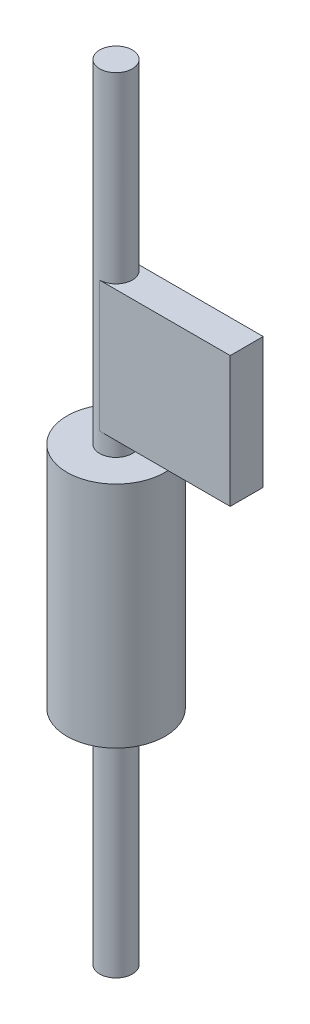
ISO-10303-21;
HEADER;
FILE_DESCRIPTION(('STEP AP214'),'2;1');
FILE_NAME('part.step','',(''),(''),'','','');
FILE_SCHEMA(('AUTOMOTIVE_DESIGN { 1 0 10303 214 1 1 1 1 }'));
ENDSEC;
DATA;
#1=APPLICATION_CONTEXT('core data for automotive mechanical design processes');
#2=APPLICATION_PROTOCOL_DEFINITION('international standard','automotive_design',2000,#1);
#3=PRODUCT_CONTEXT('',#1,'mechanical');
#4=PRODUCT('Part','Part','',(#3));
#5=PRODUCT_RELATED_PRODUCT_CATEGORY('part','',(#4));
#6=PRODUCT_DEFINITION_FORMATION('','',#4);
#7=PRODUCT_DEFINITION_CONTEXT('part definition',#1,'design');
#8=PRODUCT_DEFINITION('design','',#6,#7);
#9=PRODUCT_DEFINITION_SHAPE('','',#8);
#10=(LENGTH_UNIT() NAMED_UNIT(*) SI_UNIT(.MILLI.,.METRE.));
#11=(NAMED_UNIT(*) PLANE_ANGLE_UNIT() SI_UNIT($,.RADIAN.));
#12=(NAMED_UNIT(*) SI_UNIT($,.STERADIAN.) SOLID_ANGLE_UNIT());
#13=UNCERTAINTY_MEASURE_WITH_UNIT(LENGTH_MEASURE(1.E-05),#10,'distance_accuracy_value','');
#14=(GEOMETRIC_REPRESENTATION_CONTEXT(3) GLOBAL_UNCERTAINTY_ASSIGNED_CONTEXT((#13)) GLOBAL_UNIT_ASSIGNED_CONTEXT((#10,
#11,#12)) REPRESENTATION_CONTEXT('',''));
#15=CARTESIAN_POINT('',(0.,0.,0.));
#16=DIRECTION('',(0.,0.,1.));
#17=DIRECTION('',(1.,0.,0.));
#18=AXIS2_PLACEMENT_3D('',#15,#16,#17);
#19=CARTESIAN_POINT('',(0.,152.4,0.));
#20=DIRECTION('',(0.,-1.,0.));
#21=DIRECTION('',(0.,0.,-1.));
#22=AXIS2_PLACEMENT_3D('',#19,#20,#21);
#23=CYLINDRICAL_SURFACE('',#22,3.175);
#24=CARTESIAN_POINT('',(0.,87.63,0.));
#25=DIRECTION('',(0.,1.,0.));
#26=DIRECTION('',(0.,0.,1.));
#27=AXIS2_PLACEMENT_3D('',#24,#25,#26);
#28=CIRCLE('',#27,3.175);
#29=CARTESIAN_POINT('',(0.,87.63,3.175));
#30=VERTEX_POINT('',#29);
#31=EDGE_CURVE('E39',#30,#30,#28,.T.);
#32=ORIENTED_EDGE('',*,*,#31,.T.);
#33=EDGE_LOOP('',(#32));
#34=FACE_BOUND('',#33,.T.);
#35=CARTESIAN_POINT('',(0.,152.4,0.));
#36=DIRECTION('',(0.,1.,0.));
#37=DIRECTION('',(0.,0.,1.));
#38=AXIS2_PLACEMENT_3D('',#35,#36,#37);
#39=CIRCLE('',#38,3.175);
#40=CARTESIAN_POINT('',(0.,152.4,3.175));
#41=VERTEX_POINT('',#40);
#42=EDGE_CURVE('E115',#41,#41,#39,.T.);
#43=ORIENTED_EDGE('',*,*,#42,.F.);
#44=EDGE_LOOP('',(#43));
#45=FACE_BOUND('',#44,.T.);
#46=DIRECTION('',(0.,-1.,0.));
#47=VECTOR('',#46,1.);
#48=CARTESIAN_POINT('',(0.,152.4,3.175));
#49=LINE('',#48,#47);
#50=CARTESIAN_POINT('',(0.,116.84,3.175));
#51=VERTEX_POINT('',#50);
#52=CARTESIAN_POINT('',(0.,91.44,3.175));
#53=VERTEX_POINT('',#52);
#54=EDGE_CURVE('E44',#51,#53,#49,.T.);
#55=ORIENTED_EDGE('',*,*,#54,.F.);
#56=CARTESIAN_POINT('',(0.,116.84,0.));
#57=DIRECTION('',(0.,-1.,0.));
#58=DIRECTION('',(0.,0.,-1.));
#59=AXIS2_PLACEMENT_3D('',#56,#57,#58);
#60=CIRCLE('',#59,3.175);
#61=CARTESIAN_POINT('',(0.,116.84,-3.175));
#62=VERTEX_POINT('',#61);
#63=EDGE_CURVE('E126',#62,#51,#60,.T.);
#64=ORIENTED_EDGE('',*,*,#63,.F.);
#65=DIRECTION('',(0.,-1.,0.));
#66=VECTOR('',#65,1.);
#67=CARTESIAN_POINT('',(0.,152.4,-3.175));
#68=LINE('',#67,#66);
#69=CARTESIAN_POINT('',(0.,91.44,-3.175));
#70=VERTEX_POINT('',#69);
#71=EDGE_CURVE('E122',#70,#62,#68,.F.);
#72=ORIENTED_EDGE('',*,*,#71,.F.);
#73=CARTESIAN_POINT('',(0.,91.44,0.));
#74=DIRECTION('',(0.,1.,0.));
#75=DIRECTION('',(0.,0.,1.));
#76=AXIS2_PLACEMENT_3D('',#73,#74,#75);
#77=CIRCLE('',#76,3.175);
#78=EDGE_CURVE('E51',#53,#70,#77,.T.);
#79=ORIENTED_EDGE('',*,*,#78,.F.);
#80=EDGE_LOOP('',(#55,#64,#72,#79));
#81=FACE_BOUND('',#80,.T.);
#82=ADVANCED_FACE('F36',(#34,#45,#81),#23,.T.);
#83=CARTESIAN_POINT('',(0.,152.4,0.));
#84=DIRECTION('',(0.,1.,0.));
#85=DIRECTION('',(0.,0.,1.));
#86=AXIS2_PLACEMENT_3D('',#83,#84,#85);
#87=PLANE('',#86);
#88=ORIENTED_EDGE('',*,*,#42,.T.);
#89=EDGE_LOOP('',(#88));
#90=FACE_BOUND('',#89,.T.);
#91=ADVANCED_FACE('F179',(#90),#87,.T.);
#92=CARTESIAN_POINT('',(25.4,91.44,3.20675));
#93=DIRECTION('',(0.,1.,0.));
#94=DIRECTION('',(0.,0.,1.));
#95=AXIS2_PLACEMENT_3D('',#92,#93,#94);
#96=PLANE('',#95);
#97=DIRECTION('',(0.,0.,-1.));
#98=VECTOR('',#97,1.);
#99=CARTESIAN_POINT('',(0.,91.44,3.20675));
#100=LINE('',#99,#98);
#101=CARTESIAN_POINT('',(0.,91.44,3.20675));
#102=VERTEX_POINT('',#101);
#103=EDGE_CURVE('E132',#102,#53,#100,.T.);
#104=ORIENTED_EDGE('',*,*,#103,.T.);
#105=ORIENTED_EDGE('',*,*,#78,.T.);
#106=CARTESIAN_POINT('',(0.,91.44,-3.20675));
#107=VERTEX_POINT('',#106);
#108=EDGE_CURVE('E136',#70,#107,#100,.T.);
#109=ORIENTED_EDGE('',*,*,#108,.T.);
#110=DIRECTION('',(-1.,0.,0.));
#111=VECTOR('',#110,1.);
#112=CARTESIAN_POINT('',(25.4,91.44,-3.20675));
#113=LINE('',#112,#111);
#114=CARTESIAN_POINT('',(25.4,91.44,-3.20675));
#115=VERTEX_POINT('',#114);
#116=EDGE_CURVE('E94',#115,#107,#113,.T.);
#117=ORIENTED_EDGE('',*,*,#116,.F.);
#118=DIRECTION('',(0.,0.,-1.));
#119=VECTOR('',#118,1.);
#120=CARTESIAN_POINT('',(25.4,91.44,3.20675));
#121=LINE('',#120,#119);
#122=CARTESIAN_POINT('',(25.4,91.44,3.20675));
#123=VERTEX_POINT('',#122);
#124=EDGE_CURVE('E86',#123,#115,#121,.T.);
#125=ORIENTED_EDGE('',*,*,#124,.F.);
#126=DIRECTION('',(-1.,0.,0.));
#127=VECTOR('',#126,1.);
#128=CARTESIAN_POINT('',(25.4,91.44,3.20675));
#129=LINE('',#128,#127);
#130=EDGE_CURVE('E91',#123,#102,#129,.T.);
#131=ORIENTED_EDGE('',*,*,#130,.T.);
#132=EDGE_LOOP('',(#104,#105,#109,#117,#125,#131));
#133=FACE_BOUND('',#132,.T.);
#134=ADVANCED_FACE('F89',(#133),#96,.F.);
#135=CARTESIAN_POINT('',(25.4,116.84,3.20675));
#136=DIRECTION('',(0.,-1.,0.));
#137=DIRECTION('',(0.,0.,-1.));
#138=AXIS2_PLACEMENT_3D('',#135,#136,#137);
#139=PLANE('',#138);
#140=DIRECTION('',(0.,0.,1.));
#141=VECTOR('',#140,1.);
#142=CARTESIAN_POINT('',(0.,116.84,3.20675));
#143=LINE('',#142,#141);
#144=CARTESIAN_POINT('',(0.,116.84,-3.20675));
#145=VERTEX_POINT('',#144);
#146=EDGE_CURVE('E107',#145,#62,#143,.T.);
#147=ORIENTED_EDGE('',*,*,#146,.T.);
#148=ORIENTED_EDGE('',*,*,#63,.T.);
#149=CARTESIAN_POINT('',(0.,116.84,3.20675));
#150=VERTEX_POINT('',#149);
#151=EDGE_CURVE('E133',#51,#150,#143,.T.);
#152=ORIENTED_EDGE('',*,*,#151,.T.);
#153=DIRECTION('',(-1.,0.,0.));
#154=VECTOR('',#153,1.);
#155=CARTESIAN_POINT('',(25.4,116.84,3.20675));
#156=LINE('',#155,#154);
#157=CARTESIAN_POINT('',(25.4,116.84,3.20675));
#158=VERTEX_POINT('',#157);
#159=EDGE_CURVE('E144',#158,#150,#156,.T.);
#160=ORIENTED_EDGE('',*,*,#159,.F.);
#161=DIRECTION('',(0.,0.,1.));
#162=VECTOR('',#161,1.);
#163=CARTESIAN_POINT('',(25.4,116.84,3.20675));
#164=LINE('',#163,#162);
#165=CARTESIAN_POINT('',(25.4,116.84,-3.20675));
#166=VERTEX_POINT('',#165);
#167=EDGE_CURVE('E103',#166,#158,#164,.T.);
#168=ORIENTED_EDGE('',*,*,#167,.F.);
#169=DIRECTION('',(-1.,0.,0.));
#170=VECTOR('',#169,1.);
#171=CARTESIAN_POINT('',(25.4,116.84,-3.20675));
#172=LINE('',#171,#170);
#173=EDGE_CURVE('E117',#166,#145,#172,.T.);
#174=ORIENTED_EDGE('',*,*,#173,.T.);
#175=EDGE_LOOP('',(#147,#148,#152,#160,#168,#174));
#176=FACE_BOUND('',#175,.T.);
#177=ADVANCED_FACE('F149',(#176),#139,.F.);
#178=CARTESIAN_POINT('',(0.,0.,0.));
#179=DIRECTION('',(1.,0.,0.));
#180=DIRECTION('',(0.,0.,-1.));
#181=AXIS2_PLACEMENT_3D('',#178,#179,#180);
#182=PLANE('',#181);
#183=ORIENTED_EDGE('',*,*,#151,.F.);
#184=ORIENTED_EDGE('',*,*,#54,.T.);
#185=ORIENTED_EDGE('',*,*,#103,.F.);
#186=DIRECTION('',(0.,-1.,0.));
#187=VECTOR('',#186,1.);
#188=CARTESIAN_POINT('',(0.,116.84,3.20675));
#189=LINE('',#188,#187);
#190=EDGE_CURVE('E111',#150,#102,#189,.T.);
#191=ORIENTED_EDGE('',*,*,#190,.F.);
#192=EDGE_LOOP('',(#183,#184,#185,#191));
#193=FACE_BOUND('',#192,.T.);
#194=ADVANCED_FACE('F131',(#193),#182,.F.);
#195=ORIENTED_EDGE('',*,*,#108,.F.);
#196=ORIENTED_EDGE('',*,*,#71,.T.);
#197=ORIENTED_EDGE('',*,*,#146,.F.);
#198=DIRECTION('',(0.,1.,0.));
#199=VECTOR('',#198,1.);
#200=CARTESIAN_POINT('',(0.,116.84,-3.20675));
#201=LINE('',#200,#199);
#202=EDGE_CURVE('E135',#107,#145,#201,.T.);
#203=ORIENTED_EDGE('',*,*,#202,.F.);
#204=EDGE_LOOP('',(#195,#196,#197,#203));
#205=FACE_BOUND('',#204,.T.);
#206=ADVANCED_FACE('F153',(#205),#182,.F.);
#207=CARTESIAN_POINT('',(25.4,116.84,3.20675));
#208=DIRECTION('',(0.,0.,-1.));
#209=DIRECTION('',(0.,1.,0.));
#210=AXIS2_PLACEMENT_3D('',#207,#208,#209);
#211=PLANE('',#210);
#212=ORIENTED_EDGE('',*,*,#190,.T.);
#213=ORIENTED_EDGE('',*,*,#130,.F.);
#214=DIRECTION('',(0.,-1.,0.));
#215=VECTOR('',#214,1.);
#216=CARTESIAN_POINT('',(25.4,116.84,3.20675));
#217=LINE('',#216,#215);
#218=EDGE_CURVE('E98',#158,#123,#217,.T.);
#219=ORIENTED_EDGE('',*,*,#218,.F.);
#220=ORIENTED_EDGE('',*,*,#159,.T.);
#221=EDGE_LOOP('',(#212,#213,#219,#220));
#222=FACE_BOUND('',#221,.T.);
#223=ADVANCED_FACE('F109',(#222),#211,.F.);
#224=CARTESIAN_POINT('',(25.4,116.84,-3.20675));
#225=DIRECTION('',(0.,0.,1.));
#226=DIRECTION('',(0.,-1.,0.));
#227=AXIS2_PLACEMENT_3D('',#224,#225,#226);
#228=PLANE('',#227);
#229=ORIENTED_EDGE('',*,*,#202,.T.);
#230=ORIENTED_EDGE('',*,*,#173,.F.);
#231=DIRECTION('',(0.,1.,0.));
#232=VECTOR('',#231,1.);
#233=CARTESIAN_POINT('',(25.4,116.84,-3.20675));
#234=LINE('',#233,#232);
#235=EDGE_CURVE('E97',#115,#166,#234,.T.);
#236=ORIENTED_EDGE('',*,*,#235,.F.);
#237=ORIENTED_EDGE('',*,*,#116,.T.);
#238=EDGE_LOOP('',(#229,#230,#236,#237));
#239=FACE_BOUND('',#238,.T.);
#240=ADVANCED_FACE('F166',(#239),#228,.F.);
#241=CARTESIAN_POINT('',(25.4,0.,0.));
#242=DIRECTION('',(1.,0.,0.));
#243=DIRECTION('',(0.,0.,-1.));
#244=AXIS2_PLACEMENT_3D('',#241,#242,#243);
#245=PLANE('',#244);
#246=ORIENTED_EDGE('',*,*,#218,.T.);
#247=ORIENTED_EDGE('',*,*,#124,.T.);
#248=ORIENTED_EDGE('',*,*,#235,.T.);
#249=ORIENTED_EDGE('',*,*,#167,.T.);
#250=EDGE_LOOP('',(#246,#247,#248,#249));
#251=FACE_BOUND('',#250,.T.);
#252=ADVANCED_FACE('F101',(#251),#245,.T.);
#253=CARTESIAN_POINT('',(0.,87.63,0.));
#254=DIRECTION('',(0.,1.,0.));
#255=DIRECTION('',(0.,0.,1.));
#256=AXIS2_PLACEMENT_3D('',#253,#254,#255);
#257=PLANE('',#256);
#258=CARTESIAN_POINT('',(0.,87.63,0.));
#259=DIRECTION('',(0.,1.,0.));
#260=DIRECTION('',(0.,0.,1.));
#261=AXIS2_PLACEMENT_3D('',#258,#259,#260);
#262=CIRCLE('',#261,9.525);
#263=CARTESIAN_POINT('',(0.,87.63,9.525));
#264=VERTEX_POINT('',#263);
#265=EDGE_CURVE('E155',#264,#264,#262,.T.);
#266=ORIENTED_EDGE('',*,*,#265,.T.);
#267=EDGE_LOOP('',(#266));
#268=FACE_BOUND('',#267,.T.);
#269=ORIENTED_EDGE('',*,*,#31,.F.);
#270=EDGE_LOOP('',(#269));
#271=FACE_BOUND('',#270,.T.);
#272=ADVANCED_FACE('F173',(#268,#271),#257,.T.);
#273=CARTESIAN_POINT('',(0.,43.18,0.));
#274=DIRECTION('',(0.,1.,0.));
#275=DIRECTION('',(0.,0.,1.));
#276=AXIS2_PLACEMENT_3D('',#273,#274,#275);
#277=PLANE('',#276);
#278=CARTESIAN_POINT('',(0.,43.18,0.));
#279=DIRECTION('',(0.,1.,0.));
#280=DIRECTION('',(0.,0.,1.));
#281=AXIS2_PLACEMENT_3D('',#278,#279,#280);
#282=CIRCLE('',#281,9.525);
#283=CARTESIAN_POINT('',(0.,43.18,9.525));
#284=VERTEX_POINT('',#283);
#285=EDGE_CURVE('E159',#284,#284,#282,.T.);
#286=ORIENTED_EDGE('',*,*,#285,.F.);
#287=EDGE_LOOP('',(#286));
#288=FACE_BOUND('',#287,.T.);
#289=CARTESIAN_POINT('',(0.,43.18,0.));
#290=DIRECTION('',(0.,1.,0.));
#291=DIRECTION('',(0.,0.,1.));
#292=AXIS2_PLACEMENT_3D('',#289,#290,#291);
#293=CIRCLE('',#292,3.175);
#294=CARTESIAN_POINT('',(0.,43.18,3.175));
#295=VERTEX_POINT('',#294);
#296=EDGE_CURVE('E11',#295,#295,#293,.T.);
#297=ORIENTED_EDGE('',*,*,#296,.T.);
#298=EDGE_LOOP('',(#297));
#299=FACE_BOUND('',#298,.T.);
#300=ADVANCED_FACE('F199',(#288,#299),#277,.F.);
#301=CARTESIAN_POINT('',(0.,87.63,0.));
#302=DIRECTION('',(0.,-1.,0.));
#303=DIRECTION('',(0.,0.,-1.));
#304=AXIS2_PLACEMENT_3D('',#301,#302,#303);
#305=CYLINDRICAL_SURFACE('',#304,9.525);
#306=ORIENTED_EDGE('',*,*,#265,.F.);
#307=EDGE_LOOP('',(#306));
#308=FACE_BOUND('',#307,.T.);
#309=ORIENTED_EDGE('',*,*,#285,.T.);
#310=EDGE_LOOP('',(#309));
#311=FACE_BOUND('',#310,.T.);
#312=ADVANCED_FACE('F193',(#308,#311),#305,.T.);
#313=CARTESIAN_POINT('',(0.,0.,0.));
#314=DIRECTION('',(0.,1.,0.));
#315=DIRECTION('',(0.,0.,1.));
#316=AXIS2_PLACEMENT_3D('',#313,#314,#315);
#317=PLANE('',#316);
#318=CARTESIAN_POINT('',(0.,0.,0.));
#319=DIRECTION('',(0.,1.,0.));
#320=DIRECTION('',(0.,0.,1.));
#321=AXIS2_PLACEMENT_3D('',#318,#319,#320);
#322=CIRCLE('',#321,3.175);
#323=CARTESIAN_POINT('',(0.,0.,3.175));
#324=VERTEX_POINT('',#323);
#325=EDGE_CURVE('E112',#324,#324,#322,.T.);
#326=ORIENTED_EDGE('',*,*,#325,.F.);
#327=EDGE_LOOP('',(#326));
#328=FACE_BOUND('',#327,.T.);
#329=ADVANCED_FACE('F188',(#328),#317,.F.);
#330=ORIENTED_EDGE('',*,*,#325,.T.);
#331=EDGE_LOOP('',(#330));
#332=FACE_BOUND('',#331,.T.);
#333=ORIENTED_EDGE('',*,*,#296,.F.);
#334=EDGE_LOOP('',(#333));
#335=FACE_BOUND('',#334,.T.);
#336=ADVANCED_FACE('F180',(#332,#335),#23,.T.);
#337=CLOSED_SHELL('',(#82,#91,#134,#177,#194,#206,#223,#240,#252,#272,#300,#312,#329,#336));
#338=MANIFOLD_SOLID_BREP('B2',#337);
#339=ADVANCED_BREP_SHAPE_REPRESENTATION('',(#18,#338),#14);
#340=SHAPE_DEFINITION_REPRESENTATION(#9,#339);
ENDSEC;
END-ISO-10303-21;
